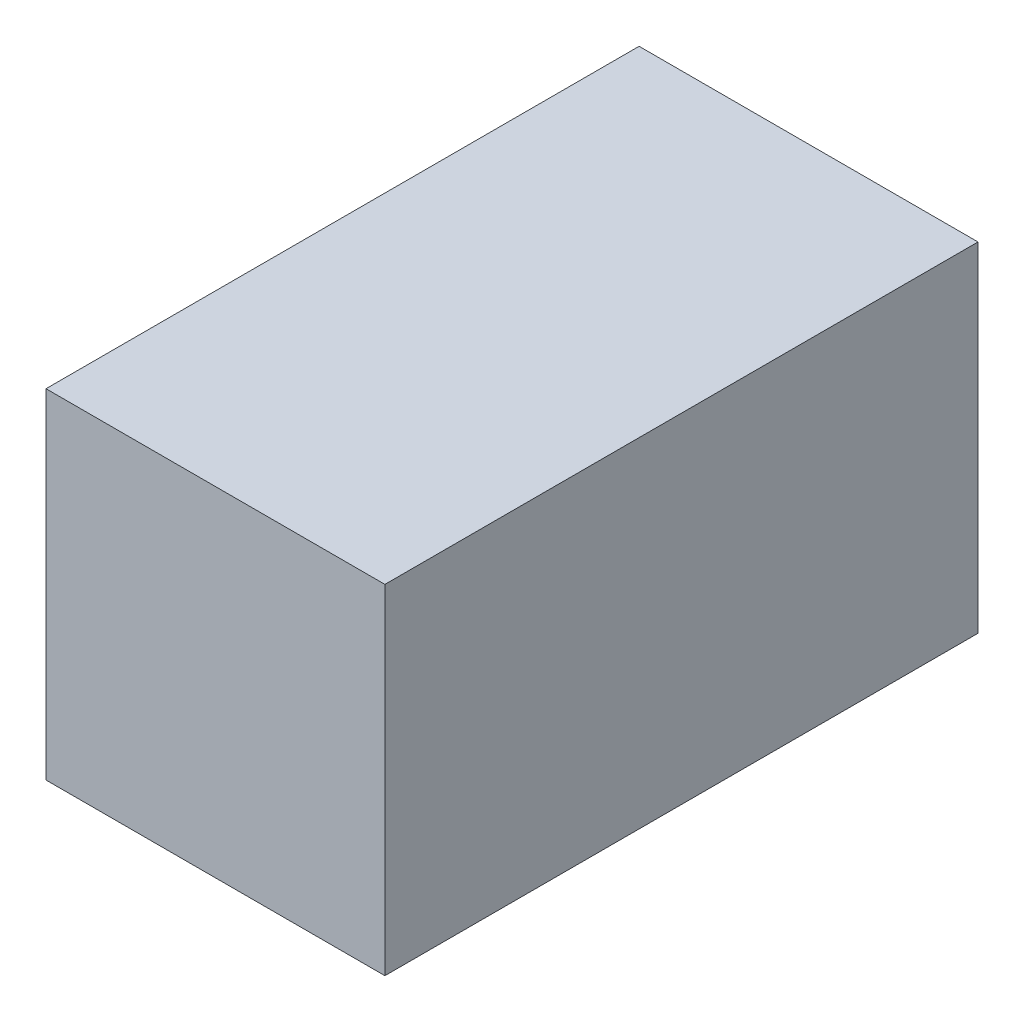
ISO-10303-21;
HEADER;
FILE_DESCRIPTION(('STEP AP214'),'2;1');
FILE_NAME('part.step','',(''),(''),'','','');
FILE_SCHEMA(('AUTOMOTIVE_DESIGN { 1 0 10303 214 1 1 1 1 }'));
ENDSEC;
DATA;
#1=APPLICATION_CONTEXT('core data for automotive mechanical design processes');
#2=APPLICATION_PROTOCOL_DEFINITION('international standard','automotive_design',2000,#1);
#3=PRODUCT_CONTEXT('',#1,'mechanical');
#4=PRODUCT('Part','Part','',(#3));
#5=PRODUCT_RELATED_PRODUCT_CATEGORY('part','',(#4));
#6=PRODUCT_DEFINITION_FORMATION('','',#4);
#7=PRODUCT_DEFINITION_CONTEXT('part definition',#1,'design');
#8=PRODUCT_DEFINITION('design','',#6,#7);
#9=PRODUCT_DEFINITION_SHAPE('','',#8);
#10=(LENGTH_UNIT() NAMED_UNIT(*) SI_UNIT(.MILLI.,.METRE.));
#11=(NAMED_UNIT(*) PLANE_ANGLE_UNIT() SI_UNIT($,.RADIAN.));
#12=(NAMED_UNIT(*) SI_UNIT($,.STERADIAN.) SOLID_ANGLE_UNIT());
#13=UNCERTAINTY_MEASURE_WITH_UNIT(LENGTH_MEASURE(1.E-05),#10,'distance_accuracy_value','');
#14=(GEOMETRIC_REPRESENTATION_CONTEXT(3) GLOBAL_UNCERTAINTY_ASSIGNED_CONTEXT((#13)) GLOBAL_UNIT_ASSIGNED_CONTEXT((#10,
#11,#12)) REPRESENTATION_CONTEXT('',''));
#15=CARTESIAN_POINT('',(0.,0.,0.));
#16=DIRECTION('',(0.,0.,1.));
#17=DIRECTION('',(1.,0.,0.));
#18=AXIS2_PLACEMENT_3D('',#15,#16,#17);
#19=CARTESIAN_POINT('',(-19.05,25.5511904761905,-71.8420489685532));
#20=DIRECTION('',(-1.,0.,0.));
#21=DIRECTION('',(0.,0.,1.));
#22=AXIS2_PLACEMENT_3D('',#19,#20,#21);
#23=PLANE('',#22);
#24=DIRECTION('',(0.,1.,0.));
#25=VECTOR('',#24,1.);
#26=CARTESIAN_POINT('',(-19.05,25.5511904761905,0.));
#27=LINE('',#26,#25);
#28=CARTESIAN_POINT('',(-19.05,-25.2488095238095,0.));
#29=VERTEX_POINT('',#28);
#30=CARTESIAN_POINT('',(-19.05,25.5511904761905,0.));
#31=VERTEX_POINT('',#30);
#32=EDGE_CURVE('E56',#29,#31,#27,.T.);
#33=ORIENTED_EDGE('',*,*,#32,.F.);
#34=DIRECTION('',(0.,0.,1.));
#35=VECTOR('',#34,1.);
#36=CARTESIAN_POINT('',(-19.05,-25.2488095238095,-71.8420489685532));
#37=LINE('',#36,#35);
#38=CARTESIAN_POINT('',(-19.05,-25.2488095238095,88.9));
#39=VERTEX_POINT('',#38);
#40=EDGE_CURVE('E84',#29,#39,#37,.T.);
#41=ORIENTED_EDGE('',*,*,#40,.T.);
#42=DIRECTION('',(0.,-1.,0.));
#43=VECTOR('',#42,1.);
#44=CARTESIAN_POINT('',(-19.05,25.5511904761905,88.9));
#45=LINE('',#44,#43);
#46=CARTESIAN_POINT('',(-19.05,25.5511904761905,88.9));
#47=VERTEX_POINT('',#46);
#48=EDGE_CURVE('E88',#47,#39,#45,.T.);
#49=ORIENTED_EDGE('',*,*,#48,.F.);
#50=DIRECTION('',(0.,0.,1.));
#51=VECTOR('',#50,1.);
#52=CARTESIAN_POINT('',(-19.05,25.5511904761905,-71.8420489685532));
#53=LINE('',#52,#51);
#54=EDGE_CURVE('E111',#31,#47,#53,.T.);
#55=ORIENTED_EDGE('',*,*,#54,.F.);
#56=EDGE_LOOP('',(#33,#41,#49,#55));
#57=FACE_BOUND('',#56,.T.);
#58=ADVANCED_FACE('F48',(#57),#23,.T.);
#59=CARTESIAN_POINT('',(-19.05,25.5511904761905,-71.8420489685532));
#60=DIRECTION('',(0.,1.,0.));
#61=DIRECTION('',(0.,0.,1.));
#62=AXIS2_PLACEMENT_3D('',#59,#60,#61);
#63=PLANE('',#62);
#64=DIRECTION('',(1.,0.,0.));
#65=VECTOR('',#64,1.);
#66=CARTESIAN_POINT('',(-19.05,25.5511904761905,0.));
#67=LINE('',#66,#65);
#68=CARTESIAN_POINT('',(31.75,25.5511904761905,0.));
#69=VERTEX_POINT('',#68);
#70=EDGE_CURVE('E62',#31,#69,#67,.T.);
#71=ORIENTED_EDGE('',*,*,#70,.F.);
#72=ORIENTED_EDGE('',*,*,#54,.T.);
#73=DIRECTION('',(-1.,0.,0.));
#74=VECTOR('',#73,1.);
#75=CARTESIAN_POINT('',(-19.05,25.5511904761905,88.9));
#76=LINE('',#75,#74);
#77=CARTESIAN_POINT('',(31.75,25.5511904761905,88.9));
#78=VERTEX_POINT('',#77);
#79=EDGE_CURVE('E93',#78,#47,#76,.T.);
#80=ORIENTED_EDGE('',*,*,#79,.F.);
#81=DIRECTION('',(0.,0.,1.));
#82=VECTOR('',#81,1.);
#83=CARTESIAN_POINT('',(31.75,25.5511904761905,-71.8420489685532));
#84=LINE('',#83,#82);
#85=EDGE_CURVE('E114',#69,#78,#84,.T.);
#86=ORIENTED_EDGE('',*,*,#85,.F.);
#87=EDGE_LOOP('',(#71,#72,#80,#86));
#88=FACE_BOUND('',#87,.T.);
#89=ADVANCED_FACE('F120',(#88),#63,.T.);
#90=CARTESIAN_POINT('',(31.75,25.5511904761905,-71.8420489685532));
#91=DIRECTION('',(1.,0.,0.));
#92=DIRECTION('',(0.,0.,-1.));
#93=AXIS2_PLACEMENT_3D('',#90,#91,#92);
#94=PLANE('',#93);
#95=DIRECTION('',(0.,-1.,0.));
#96=VECTOR('',#95,1.);
#97=CARTESIAN_POINT('',(31.75,25.5511904761905,0.));
#98=LINE('',#97,#96);
#99=CARTESIAN_POINT('',(31.75,-25.2488095238095,0.));
#100=VERTEX_POINT('',#99);
#101=EDGE_CURVE('E113',#69,#100,#98,.T.);
#102=ORIENTED_EDGE('',*,*,#101,.F.);
#103=ORIENTED_EDGE('',*,*,#85,.T.);
#104=DIRECTION('',(0.,1.,0.));
#105=VECTOR('',#104,1.);
#106=CARTESIAN_POINT('',(31.75,25.5511904761905,88.9));
#107=LINE('',#106,#105);
#108=CARTESIAN_POINT('',(31.75,-25.2488095238095,88.9));
#109=VERTEX_POINT('',#108);
#110=EDGE_CURVE('E101',#109,#78,#107,.T.);
#111=ORIENTED_EDGE('',*,*,#110,.F.);
#112=DIRECTION('',(0.,0.,1.));
#113=VECTOR('',#112,1.);
#114=CARTESIAN_POINT('',(31.75,-25.2488095238095,-71.8420489685532));
#115=LINE('',#114,#113);
#116=EDGE_CURVE('E92',#100,#109,#115,.T.);
#117=ORIENTED_EDGE('',*,*,#116,.F.);
#118=EDGE_LOOP('',(#102,#103,#111,#117));
#119=FACE_BOUND('',#118,.T.);
#120=ADVANCED_FACE('F118',(#119),#94,.T.);
#121=CARTESIAN_POINT('',(-19.05,-25.2488095238095,-71.8420489685532));
#122=DIRECTION('',(0.,-1.,0.));
#123=DIRECTION('',(0.,0.,-1.));
#124=AXIS2_PLACEMENT_3D('',#121,#122,#123);
#125=PLANE('',#124);
#126=DIRECTION('',(-1.,0.,0.));
#127=VECTOR('',#126,1.);
#128=CARTESIAN_POINT('',(-19.05,-25.2488095238095,0.));
#129=LINE('',#128,#127);
#130=EDGE_CURVE('E12',#100,#29,#129,.T.);
#131=ORIENTED_EDGE('',*,*,#130,.F.);
#132=ORIENTED_EDGE('',*,*,#116,.T.);
#133=DIRECTION('',(1.,0.,0.));
#134=VECTOR('',#133,1.);
#135=CARTESIAN_POINT('',(-19.05,-25.2488095238095,88.9));
#136=LINE('',#135,#134);
#137=EDGE_CURVE('E95',#39,#109,#136,.T.);
#138=ORIENTED_EDGE('',*,*,#137,.F.);
#139=ORIENTED_EDGE('',*,*,#40,.F.);
#140=EDGE_LOOP('',(#131,#132,#138,#139));
#141=FACE_BOUND('',#140,.T.);
#142=ADVANCED_FACE('F96',(#141),#125,.T.);
#143=CARTESIAN_POINT('',(0.,0.,88.9));
#144=DIRECTION('',(0.,0.,1.));
#145=DIRECTION('',(1.,0.,0.));
#146=AXIS2_PLACEMENT_3D('',#143,#144,#145);
#147=PLANE('',#146);
#148=ORIENTED_EDGE('',*,*,#48,.T.);
#149=ORIENTED_EDGE('',*,*,#137,.T.);
#150=ORIENTED_EDGE('',*,*,#110,.T.);
#151=ORIENTED_EDGE('',*,*,#79,.T.);
#152=EDGE_LOOP('',(#148,#149,#150,#151));
#153=FACE_BOUND('',#152,.T.);
#154=ADVANCED_FACE('F103',(#153),#147,.T.);
#155=CARTESIAN_POINT('',(0.,0.,0.));
#156=DIRECTION('',(0.,0.,1.));
#157=DIRECTION('',(1.,0.,0.));
#158=AXIS2_PLACEMENT_3D('',#155,#156,#157);
#159=PLANE('',#158);
#160=ORIENTED_EDGE('',*,*,#32,.T.);
#161=ORIENTED_EDGE('',*,*,#70,.T.);
#162=ORIENTED_EDGE('',*,*,#101,.T.);
#163=ORIENTED_EDGE('',*,*,#130,.T.);
#164=EDGE_LOOP('',(#160,#161,#162,#163));
#165=FACE_BOUND('',#164,.T.);
#166=ADVANCED_FACE('F122',(#165),#159,.F.);
#167=CLOSED_SHELL('',(#58,#89,#120,#142,#154,#166));
#168=MANIFOLD_SOLID_BREP('B2',#167);
#169=CARTESIAN_POINT('',(-19.05,25.5511904761905,88.9));
#170=DIRECTION('',(1.,0.,0.));
#171=DIRECTION('',(0.,1.,0.));
#172=AXIS2_PLACEMENT_3D('',#169,#170,#171);
#173=PLANE('',#172);
#174=DIRECTION('',(0.,-1.,0.));
#175=VECTOR('',#174,1.);
#176=CARTESIAN_POINT('',(-19.05,25.5511904761905,0.));
#177=LINE('',#176,#175);
#178=CARTESIAN_POINT('',(-19.05,25.5511904761905,0.));
#179=VERTEX_POINT('',#178);
#180=CARTESIAN_POINT('',(-19.05,-25.2488095238095,0.));
#181=VERTEX_POINT('',#180);
#182=EDGE_CURVE('E234',#179,#181,#177,.T.);
#183=ORIENTED_EDGE('',*,*,#182,.T.);
#184=DIRECTION('',(0.,0.,-1.));
#185=VECTOR('',#184,1.);
#186=CARTESIAN_POINT('',(-19.05,-25.2488095238095,88.9));
#187=LINE('',#186,#185);
#188=CARTESIAN_POINT('',(-19.05,-25.2488095238095,88.9));
#189=VERTEX_POINT('',#188);
#190=EDGE_CURVE('E46',#189,#181,#187,.T.);
#191=ORIENTED_EDGE('',*,*,#190,.F.);
#192=DIRECTION('',(0.,-1.,0.));
#193=VECTOR('',#192,1.);
#194=CARTESIAN_POINT('',(-19.05,25.5511904761905,88.9));
#195=LINE('',#194,#193);
#196=CARTESIAN_POINT('',(-19.05,25.5511904761905,88.9));
#197=VERTEX_POINT('',#196);
#198=EDGE_CURVE('E222',#197,#189,#195,.T.);
#199=ORIENTED_EDGE('',*,*,#198,.F.);
#200=DIRECTION('',(0.,0.,-1.));
#201=VECTOR('',#200,1.);
#202=CARTESIAN_POINT('',(-19.05,25.5511904761905,88.9));
#203=LINE('',#202,#201);
#204=EDGE_CURVE('E230',#197,#179,#203,.T.);
#205=ORIENTED_EDGE('',*,*,#204,.T.);
#206=EDGE_LOOP('',(#183,#191,#199,#205));
#207=FACE_BOUND('',#206,.T.);
#208=ADVANCED_FACE('F171',(#207),#173,.F.);
#209=CARTESIAN_POINT('',(-19.05,-25.2488095238095,88.9));
#210=DIRECTION('',(0.,1.,0.));
#211=DIRECTION('',(0.,0.,1.));
#212=AXIS2_PLACEMENT_3D('',#209,#210,#211);
#213=PLANE('',#212);
#214=DIRECTION('',(1.,0.,0.));
#215=VECTOR('',#214,1.);
#216=CARTESIAN_POINT('',(-19.05,-25.2488095238095,0.));
#217=LINE('',#216,#215);
#218=CARTESIAN_POINT('',(31.75,-25.2488095238095,0.));
#219=VERTEX_POINT('',#218);
#220=EDGE_CURVE('E226',#181,#219,#217,.T.);
#221=ORIENTED_EDGE('',*,*,#220,.T.);
#222=DIRECTION('',(0.,0.,-1.));
#223=VECTOR('',#222,1.);
#224=CARTESIAN_POINT('',(31.75,-25.2488095238095,88.9));
#225=LINE('',#224,#223);
#226=CARTESIAN_POINT('',(31.75,-25.2488095238095,88.9));
#227=VERTEX_POINT('',#226);
#228=EDGE_CURVE('E179',#227,#219,#225,.T.);
#229=ORIENTED_EDGE('',*,*,#228,.F.);
#230=DIRECTION('',(1.,0.,0.));
#231=VECTOR('',#230,1.);
#232=CARTESIAN_POINT('',(-19.05,-25.2488095238095,88.9));
#233=LINE('',#232,#231);
#234=EDGE_CURVE('E217',#189,#227,#233,.T.);
#235=ORIENTED_EDGE('',*,*,#234,.F.);
#236=ORIENTED_EDGE('',*,*,#190,.T.);
#237=EDGE_LOOP('',(#221,#229,#235,#236));
#238=FACE_BOUND('',#237,.T.);
#239=ADVANCED_FACE('F225',(#238),#213,.F.);
#240=CARTESIAN_POINT('',(31.75,25.5511904761905,88.9));
#241=DIRECTION('',(-1.,0.,0.));
#242=DIRECTION('',(0.,0.,1.));
#243=AXIS2_PLACEMENT_3D('',#240,#241,#242);
#244=PLANE('',#243);
#245=DIRECTION('',(0.,1.,0.));
#246=VECTOR('',#245,1.);
#247=CARTESIAN_POINT('',(31.75,25.5511904761905,0.));
#248=LINE('',#247,#246);
#249=CARTESIAN_POINT('',(31.75,25.5511904761905,0.));
#250=VERTEX_POINT('',#249);
#251=EDGE_CURVE('E204',#219,#250,#248,.T.);
#252=ORIENTED_EDGE('',*,*,#251,.T.);
#253=DIRECTION('',(0.,0.,-1.));
#254=VECTOR('',#253,1.);
#255=CARTESIAN_POINT('',(31.75,25.5511904761905,88.9));
#256=LINE('',#255,#254);
#257=CARTESIAN_POINT('',(31.75,25.5511904761905,88.9));
#258=VERTEX_POINT('',#257);
#259=EDGE_CURVE('E227',#258,#250,#256,.T.);
#260=ORIENTED_EDGE('',*,*,#259,.F.);
#261=DIRECTION('',(0.,1.,0.));
#262=VECTOR('',#261,1.);
#263=CARTESIAN_POINT('',(31.75,25.5511904761905,88.9));
#264=LINE('',#263,#262);
#265=EDGE_CURVE('E220',#227,#258,#264,.T.);
#266=ORIENTED_EDGE('',*,*,#265,.F.);
#267=ORIENTED_EDGE('',*,*,#228,.T.);
#268=EDGE_LOOP('',(#252,#260,#266,#267));
#269=FACE_BOUND('',#268,.T.);
#270=ADVANCED_FACE('F228',(#269),#244,.F.);
#271=CARTESIAN_POINT('',(-19.05,25.5511904761905,88.9));
#272=DIRECTION('',(0.,-1.,0.));
#273=DIRECTION('',(0.,0.,-1.));
#274=AXIS2_PLACEMENT_3D('',#271,#272,#273);
#275=PLANE('',#274);
#276=DIRECTION('',(-1.,0.,0.));
#277=VECTOR('',#276,1.);
#278=CARTESIAN_POINT('',(-19.05,25.5511904761905,0.));
#279=LINE('',#278,#277);
#280=EDGE_CURVE('E210',#250,#179,#279,.T.);
#281=ORIENTED_EDGE('',*,*,#280,.T.);
#282=ORIENTED_EDGE('',*,*,#204,.F.);
#283=DIRECTION('',(-1.,0.,0.));
#284=VECTOR('',#283,1.);
#285=CARTESIAN_POINT('',(-19.05,25.5511904761905,88.9));
#286=LINE('',#285,#284);
#287=EDGE_CURVE('E187',#258,#197,#286,.T.);
#288=ORIENTED_EDGE('',*,*,#287,.F.);
#289=ORIENTED_EDGE('',*,*,#259,.T.);
#290=EDGE_LOOP('',(#281,#282,#288,#289));
#291=FACE_BOUND('',#290,.T.);
#292=ADVANCED_FACE('F241',(#291),#275,.F.);
#293=CARTESIAN_POINT('',(0.,0.,88.9));
#294=DIRECTION('',(0.,0.,1.));
#295=DIRECTION('',(1.,0.,0.));
#296=AXIS2_PLACEMENT_3D('',#293,#294,#295);
#297=PLANE('',#296);
#298=ORIENTED_EDGE('',*,*,#198,.T.);
#299=ORIENTED_EDGE('',*,*,#234,.T.);
#300=ORIENTED_EDGE('',*,*,#265,.T.);
#301=ORIENTED_EDGE('',*,*,#287,.T.);
#302=EDGE_LOOP('',(#298,#299,#300,#301));
#303=FACE_BOUND('',#302,.T.);
#304=ADVANCED_FACE('F218',(#303),#297,.T.);
#305=CARTESIAN_POINT('',(0.,0.,0.));
#306=DIRECTION('',(0.,0.,1.));
#307=DIRECTION('',(1.,0.,0.));
#308=AXIS2_PLACEMENT_3D('',#305,#306,#307);
#309=PLANE('',#308);
#310=ORIENTED_EDGE('',*,*,#182,.F.);
#311=ORIENTED_EDGE('',*,*,#280,.F.);
#312=ORIENTED_EDGE('',*,*,#251,.F.);
#313=ORIENTED_EDGE('',*,*,#220,.F.);
#314=EDGE_LOOP('',(#310,#311,#312,#313));
#315=FACE_BOUND('',#314,.T.);
#316=ADVANCED_FACE('F244',(#315),#309,.F.);
#317=CLOSED_SHELL('',(#208,#239,#270,#292,#304,#316));
#318=MANIFOLD_SOLID_BREP('B6',#317);
#319=ADVANCED_BREP_SHAPE_REPRESENTATION('',(#18,#168,#318),#14);
#320=SHAPE_DEFINITION_REPRESENTATION(#9,#319);
ENDSEC;
END-ISO-10303-21;
